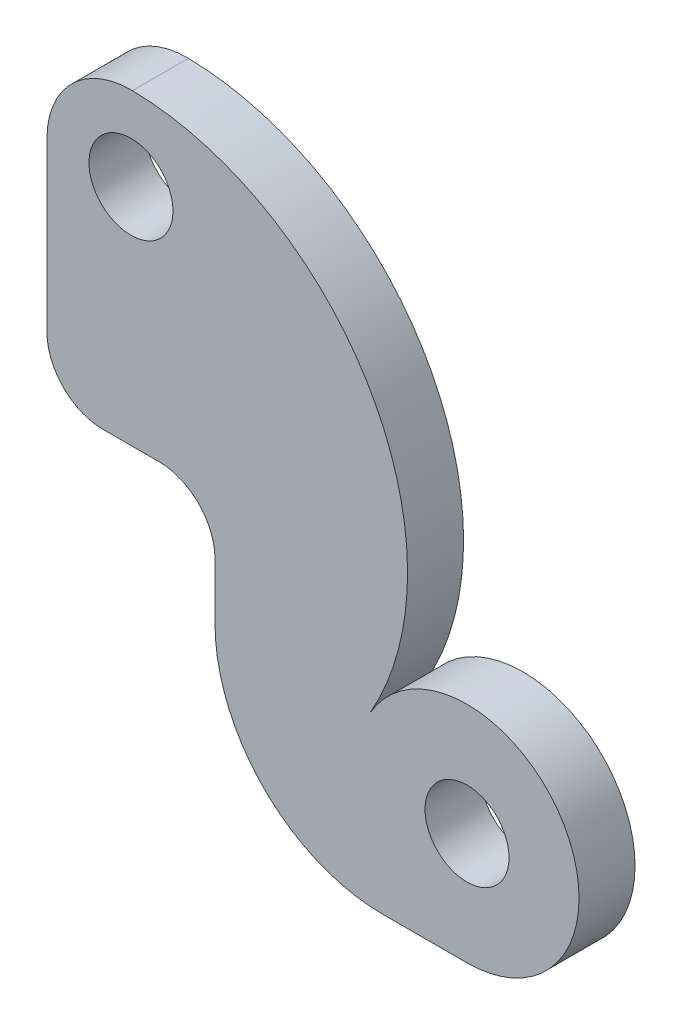
ISO-10303-21;
HEADER;
FILE_DESCRIPTION(('STEP AP214'),'2;1');
FILE_NAME('part.step','',(''),(''),'','','');
FILE_SCHEMA(('AUTOMOTIVE_DESIGN { 1 0 10303 214 1 1 1 1 }'));
ENDSEC;
DATA;
#1=APPLICATION_CONTEXT('core data for automotive mechanical design processes');
#2=APPLICATION_PROTOCOL_DEFINITION('international standard','automotive_design',2000,#1);
#3=PRODUCT_CONTEXT('',#1,'mechanical');
#4=PRODUCT('Part','Part','',(#3));
#5=PRODUCT_RELATED_PRODUCT_CATEGORY('part','',(#4));
#6=PRODUCT_DEFINITION_FORMATION('','',#4);
#7=PRODUCT_DEFINITION_CONTEXT('part definition',#1,'design');
#8=PRODUCT_DEFINITION('design','',#6,#7);
#9=PRODUCT_DEFINITION_SHAPE('','',#8);
#10=(LENGTH_UNIT() NAMED_UNIT(*) SI_UNIT(.MILLI.,.METRE.));
#11=(NAMED_UNIT(*) PLANE_ANGLE_UNIT() SI_UNIT($,.RADIAN.));
#12=(NAMED_UNIT(*) SI_UNIT($,.STERADIAN.) SOLID_ANGLE_UNIT());
#13=UNCERTAINTY_MEASURE_WITH_UNIT(LENGTH_MEASURE(1.E-05),#10,'distance_accuracy_value','');
#14=(GEOMETRIC_REPRESENTATION_CONTEXT(3) GLOBAL_UNCERTAINTY_ASSIGNED_CONTEXT((#13)) GLOBAL_UNIT_ASSIGNED_CONTEXT((#10,
#11,#12)) REPRESENTATION_CONTEXT('',''));
#15=CARTESIAN_POINT('',(0.,0.,0.));
#16=DIRECTION('',(0.,0.,1.));
#17=DIRECTION('',(1.,0.,0.));
#18=AXIS2_PLACEMENT_3D('',#15,#16,#17);
#19=CARTESIAN_POINT('',(0.,0.,5.));
#20=DIRECTION('',(0.,0.,1.));
#21=DIRECTION('',(1.,0.,0.));
#22=AXIS2_PLACEMENT_3D('',#19,#20,#21);
#23=PLANE('',#22);
#24=CARTESIAN_POINT('',(0.,0.,5.));
#25=DIRECTION('',(0.,0.,1.));
#26=DIRECTION('',(1.,0.,0.));
#27=AXIS2_PLACEMENT_3D('',#24,#25,#26);
#28=CIRCLE('',#27,7.5);
#29=CARTESIAN_POINT('',(7.5,0.,5.));
#30=VERTEX_POINT('',#29);
#31=EDGE_CURVE('E146',#30,#30,#28,.T.);
#32=ORIENTED_EDGE('',*,*,#31,.F.);
#33=EDGE_LOOP('',(#32));
#34=FACE_BOUND('',#33,.T.);
#35=CARTESIAN_POINT('',(0.,0.,5.));
#36=DIRECTION('',(0.,0.,1.));
#37=DIRECTION('',(1.,0.,0.));
#38=AXIS2_PLACEMENT_3D('',#35,#36,#37);
#39=CIRCLE('',#38,15.);
#40=CARTESIAN_POINT('',(0.265123412844575,14.9976568028463,5.));
#41=VERTEX_POINT('',#40);
#42=CARTESIAN_POINT('',(-15.,0.,5.));
#43=VERTEX_POINT('',#42);
#44=EDGE_CURVE('E161',#41,#43,#39,.T.);
#45=ORIENTED_EDGE('',*,*,#44,.T.);
#46=DIRECTION('',(0.,-1.,0.));
#47=VECTOR('',#46,1.);
#48=CARTESIAN_POINT('',(-15.,0.,5.));
#49=LINE('',#48,#47);
#50=CARTESIAN_POINT('',(-15.,-29.9999999999999,5.));
#51=VERTEX_POINT('',#50);
#52=EDGE_CURVE('E99',#43,#51,#49,.T.);
#53=ORIENTED_EDGE('',*,*,#52,.T.);
#54=CARTESIAN_POINT('',(-5.,-30.,5.));
#55=DIRECTION('',(0.,0.,1.));
#56=DIRECTION('',(1.,0.,0.));
#57=AXIS2_PLACEMENT_3D('',#54,#55,#56);
#58=CIRCLE('',#57,10.);
#59=CARTESIAN_POINT('',(-4.99999999999993,-40.,5.));
#60=VERTEX_POINT('',#59);
#61=EDGE_CURVE('E182',#51,#60,#58,.T.);
#62=ORIENTED_EDGE('',*,*,#61,.T.);
#63=DIRECTION('',(1.,0.,0.));
#64=VECTOR('',#63,1.);
#65=CARTESIAN_POINT('',(-4.99999999999993,-40.,5.));
#66=LINE('',#65,#64);
#67=CARTESIAN_POINT('',(4.99999999999994,-40.,5.));
#68=VERTEX_POINT('',#67);
#69=EDGE_CURVE('E201',#60,#68,#66,.T.);
#70=ORIENTED_EDGE('',*,*,#69,.T.);
#71=CARTESIAN_POINT('',(5.00000000000001,-50.,5.));
#72=DIRECTION('',(0.,0.,-1.));
#73=DIRECTION('',(-1.,0.,0.));
#74=AXIS2_PLACEMENT_3D('',#71,#72,#73);
#75=CIRCLE('',#74,10.);
#76=CARTESIAN_POINT('',(15.,-50.0000000000001,5.));
#77=VERTEX_POINT('',#76);
#78=EDGE_CURVE('E198',#68,#77,#75,.T.);
#79=ORIENTED_EDGE('',*,*,#78,.T.);
#80=DIRECTION('',(0.,-1.,0.));
#81=VECTOR('',#80,1.);
#82=CARTESIAN_POINT('',(15.,-50.0000000000001,5.));
#83=LINE('',#82,#81);
#84=CARTESIAN_POINT('',(15.,-59.9999999999998,5.));
#85=VERTEX_POINT('',#84);
#86=EDGE_CURVE('E200',#77,#85,#83,.T.);
#87=ORIENTED_EDGE('',*,*,#86,.T.);
#88=CARTESIAN_POINT('',(45.,-60.,5.));
#89=DIRECTION('',(0.,0.,1.));
#90=DIRECTION('',(1.,0.,0.));
#91=AXIS2_PLACEMENT_3D('',#88,#89,#90);
#92=CIRCLE('',#91,30.);
#93=CARTESIAN_POINT('',(45.0000000000002,-90.,5.));
#94=VERTEX_POINT('',#93);
#95=EDGE_CURVE('E124',#85,#94,#92,.T.);
#96=ORIENTED_EDGE('',*,*,#95,.T.);
#97=DIRECTION('',(1.,0.,0.));
#98=VECTOR('',#97,1.);
#99=CARTESIAN_POINT('',(45.0000000000002,-90.,5.));
#100=LINE('',#99,#98);
#101=CARTESIAN_POINT('',(60.,-90.,5.));
#102=VERTEX_POINT('',#101);
#103=EDGE_CURVE('E118',#94,#102,#100,.T.);
#104=ORIENTED_EDGE('',*,*,#103,.T.);
#105=CARTESIAN_POINT('',(60.,-70.,5.));
#106=DIRECTION('',(0.,0.,1.));
#107=DIRECTION('',(1.,0.,0.));
#108=AXIS2_PLACEMENT_3D('',#105,#106,#107);
#109=CIRCLE('',#108,20.0000000000001);
#110=CARTESIAN_POINT('',(42.6803939152464,-59.9984378685643,5.));
#111=VERTEX_POINT('',#110);
#112=EDGE_CURVE('E122',#102,#111,#109,.T.);
#113=ORIENTED_EDGE('',*,*,#112,.T.);
#114=CARTESIAN_POINT('',(-0.618621296637353,-34.9945325399747,5.));
#115=DIRECTION('',(0.,0.,1.));
#116=DIRECTION('',(-1.,0.,0.));
#117=AXIS2_PLACEMENT_3D('',#114,#115,#116);
#118=CIRCLE('',#117,50.);
#119=EDGE_CURVE('E50',#111,#41,#118,.T.);
#120=ORIENTED_EDGE('',*,*,#119,.T.);
#121=EDGE_LOOP('',(#45,#53,#62,#70,#79,#87,#96,#104,#113,#120));
#122=FACE_BOUND('',#121,.T.);
#123=CARTESIAN_POINT('',(60.,-70.,5.));
#124=DIRECTION('',(0.,0.,1.));
#125=DIRECTION('',(1.,0.,0.));
#126=AXIS2_PLACEMENT_3D('',#123,#124,#125);
#127=CIRCLE('',#126,7.5);
#128=CARTESIAN_POINT('',(67.5,-70.,5.));
#129=VERTEX_POINT('',#128);
#130=EDGE_CURVE('E212',#129,#129,#127,.T.);
#131=ORIENTED_EDGE('',*,*,#130,.F.);
#132=EDGE_LOOP('',(#131));
#133=FACE_BOUND('',#132,.T.);
#134=ADVANCED_FACE('F33',(#34,#122,#133),#23,.T.);
#135=CARTESIAN_POINT('',(0.,0.,-5.));
#136=DIRECTION('',(0.,0.,1.));
#137=DIRECTION('',(1.,0.,0.));
#138=AXIS2_PLACEMENT_3D('',#135,#136,#137);
#139=PLANE('',#138);
#140=CARTESIAN_POINT('',(0.,0.,-5.));
#141=DIRECTION('',(0.,0.,1.));
#142=DIRECTION('',(1.,0.,0.));
#143=AXIS2_PLACEMENT_3D('',#140,#141,#142);
#144=CIRCLE('',#143,15.);
#145=CARTESIAN_POINT('',(0.265123412844575,14.9976568028463,-5.));
#146=VERTEX_POINT('',#145);
#147=CARTESIAN_POINT('',(-15.,0.,-5.));
#148=VERTEX_POINT('',#147);
#149=EDGE_CURVE('E142',#146,#148,#144,.T.);
#150=ORIENTED_EDGE('',*,*,#149,.F.);
#151=CARTESIAN_POINT('',(-0.618621296637353,-34.9945325399747,-5.));
#152=DIRECTION('',(0.,0.,1.));
#153=DIRECTION('',(-1.,0.,0.));
#154=AXIS2_PLACEMENT_3D('',#151,#152,#153);
#155=CIRCLE('',#154,50.);
#156=CARTESIAN_POINT('',(42.6803939152464,-59.9984378685643,-5.));
#157=VERTEX_POINT('',#156);
#158=EDGE_CURVE('E91',#157,#146,#155,.T.);
#159=ORIENTED_EDGE('',*,*,#158,.F.);
#160=CARTESIAN_POINT('',(60.,-70.,-5.));
#161=DIRECTION('',(0.,0.,1.));
#162=DIRECTION('',(1.,0.,0.));
#163=AXIS2_PLACEMENT_3D('',#160,#161,#162);
#164=CIRCLE('',#163,20.0000000000001);
#165=CARTESIAN_POINT('',(60.,-90.,-5.));
#166=VERTEX_POINT('',#165);
#167=EDGE_CURVE('E85',#166,#157,#164,.T.);
#168=ORIENTED_EDGE('',*,*,#167,.F.);
#169=DIRECTION('',(1.,0.,0.));
#170=VECTOR('',#169,1.);
#171=CARTESIAN_POINT('',(45.0000000000002,-90.,-5.));
#172=LINE('',#171,#170);
#173=CARTESIAN_POINT('',(45.0000000000002,-90.,-5.));
#174=VERTEX_POINT('',#173);
#175=EDGE_CURVE('E132',#174,#166,#172,.T.);
#176=ORIENTED_EDGE('',*,*,#175,.F.);
#177=CARTESIAN_POINT('',(45.,-60.,-5.));
#178=DIRECTION('',(0.,0.,1.));
#179=DIRECTION('',(1.,0.,0.));
#180=AXIS2_PLACEMENT_3D('',#177,#178,#179);
#181=CIRCLE('',#180,30.);
#182=CARTESIAN_POINT('',(15.,-59.9999999999998,-5.));
#183=VERTEX_POINT('',#182);
#184=EDGE_CURVE('E156',#183,#174,#181,.T.);
#185=ORIENTED_EDGE('',*,*,#184,.F.);
#186=DIRECTION('',(0.,-1.,0.));
#187=VECTOR('',#186,1.);
#188=CARTESIAN_POINT('',(15.,-50.0000000000001,-5.));
#189=LINE('',#188,#187);
#190=CARTESIAN_POINT('',(15.,-50.0000000000001,-5.));
#191=VERTEX_POINT('',#190);
#192=EDGE_CURVE('E154',#191,#183,#189,.T.);
#193=ORIENTED_EDGE('',*,*,#192,.F.);
#194=CARTESIAN_POINT('',(5.00000000000001,-50.,-5.));
#195=DIRECTION('',(0.,0.,-1.));
#196=DIRECTION('',(-1.,0.,0.));
#197=AXIS2_PLACEMENT_3D('',#194,#195,#196);
#198=CIRCLE('',#197,10.);
#199=CARTESIAN_POINT('',(4.99999999999994,-40.,-5.));
#200=VERTEX_POINT('',#199);
#201=EDGE_CURVE('E152',#200,#191,#198,.T.);
#202=ORIENTED_EDGE('',*,*,#201,.F.);
#203=DIRECTION('',(1.,0.,0.));
#204=VECTOR('',#203,1.);
#205=CARTESIAN_POINT('',(-4.99999999999993,-40.,-5.));
#206=LINE('',#205,#204);
#207=CARTESIAN_POINT('',(-4.99999999999993,-40.,-5.));
#208=VERTEX_POINT('',#207);
#209=EDGE_CURVE('E150',#208,#200,#206,.T.);
#210=ORIENTED_EDGE('',*,*,#209,.F.);
#211=CARTESIAN_POINT('',(-5.,-30.,-5.));
#212=DIRECTION('',(0.,0.,1.));
#213=DIRECTION('',(1.,0.,0.));
#214=AXIS2_PLACEMENT_3D('',#211,#212,#213);
#215=CIRCLE('',#214,10.);
#216=CARTESIAN_POINT('',(-15.,-29.9999999999999,-5.));
#217=VERTEX_POINT('',#216);
#218=EDGE_CURVE('E148',#217,#208,#215,.T.);
#219=ORIENTED_EDGE('',*,*,#218,.F.);
#220=DIRECTION('',(0.,-1.,0.));
#221=VECTOR('',#220,1.);
#222=CARTESIAN_POINT('',(-15.,0.,-5.));
#223=LINE('',#222,#221);
#224=EDGE_CURVE('E145',#148,#217,#223,.T.);
#225=ORIENTED_EDGE('',*,*,#224,.F.);
#226=EDGE_LOOP('',(#150,#159,#168,#176,#185,#193,#202,#210,#219,#225));
#227=FACE_BOUND('',#226,.T.);
#228=CARTESIAN_POINT('',(0.,0.,-5.));
#229=DIRECTION('',(0.,0.,1.));
#230=DIRECTION('',(1.,0.,0.));
#231=AXIS2_PLACEMENT_3D('',#228,#229,#230);
#232=CIRCLE('',#231,7.5);
#233=CARTESIAN_POINT('',(7.5,0.,-5.));
#234=VERTEX_POINT('',#233);
#235=EDGE_CURVE('E209',#234,#234,#232,.T.);
#236=ORIENTED_EDGE('',*,*,#235,.T.);
#237=EDGE_LOOP('',(#236));
#238=FACE_BOUND('',#237,.T.);
#239=CARTESIAN_POINT('',(60.,-70.,-5.));
#240=DIRECTION('',(0.,0.,1.));
#241=DIRECTION('',(1.,0.,0.));
#242=AXIS2_PLACEMENT_3D('',#239,#240,#241);
#243=CIRCLE('',#242,7.5);
#244=CARTESIAN_POINT('',(67.5,-70.,-5.));
#245=VERTEX_POINT('',#244);
#246=EDGE_CURVE('E215',#245,#245,#243,.T.);
#247=ORIENTED_EDGE('',*,*,#246,.T.);
#248=EDGE_LOOP('',(#247));
#249=FACE_BOUND('',#248,.T.);
#250=ADVANCED_FACE('F186',(#227,#238,#249),#139,.F.);
#251=CARTESIAN_POINT('',(0.,0.,5.));
#252=DIRECTION('',(0.,0.,-1.));
#253=DIRECTION('',(-1.,0.,0.));
#254=AXIS2_PLACEMENT_3D('',#251,#252,#253);
#255=CYLINDRICAL_SURFACE('',#254,15.);
#256=ORIENTED_EDGE('',*,*,#149,.T.);
#257=DIRECTION('',(0.,0.,-1.));
#258=VECTOR('',#257,1.);
#259=CARTESIAN_POINT('',(-15.,0.,5.));
#260=LINE('',#259,#258);
#261=EDGE_CURVE('E11',#43,#148,#260,.T.);
#262=ORIENTED_EDGE('',*,*,#261,.F.);
#263=ORIENTED_EDGE('',*,*,#44,.F.);
#264=DIRECTION('',(0.,0.,-1.));
#265=VECTOR('',#264,1.);
#266=CARTESIAN_POINT('',(0.265123412844575,14.9976568028463,5.));
#267=LINE('',#266,#265);
#268=EDGE_CURVE('E138',#41,#146,#267,.T.);
#269=ORIENTED_EDGE('',*,*,#268,.T.);
#270=EDGE_LOOP('',(#256,#262,#263,#269));
#271=FACE_BOUND('',#270,.T.);
#272=ADVANCED_FACE('F35',(#271),#255,.T.);
#273=CARTESIAN_POINT('',(-15.,0.,5.));
#274=DIRECTION('',(1.,0.,0.));
#275=DIRECTION('',(0.,0.,-1.));
#276=AXIS2_PLACEMENT_3D('',#273,#274,#275);
#277=PLANE('',#276);
#278=ORIENTED_EDGE('',*,*,#224,.T.);
#279=DIRECTION('',(0.,0.,-1.));
#280=VECTOR('',#279,1.);
#281=CARTESIAN_POINT('',(-15.,-29.9999999999999,5.));
#282=LINE('',#281,#280);
#283=EDGE_CURVE('E42',#51,#217,#282,.T.);
#284=ORIENTED_EDGE('',*,*,#283,.F.);
#285=ORIENTED_EDGE('',*,*,#52,.F.);
#286=ORIENTED_EDGE('',*,*,#261,.T.);
#287=EDGE_LOOP('',(#278,#284,#285,#286));
#288=FACE_BOUND('',#287,.T.);
#289=ADVANCED_FACE('F255',(#288),#277,.F.);
#290=CARTESIAN_POINT('',(-5.,-30.,5.));
#291=DIRECTION('',(0.,0.,-1.));
#292=DIRECTION('',(-1.,0.,0.));
#293=AXIS2_PLACEMENT_3D('',#290,#291,#292);
#294=CYLINDRICAL_SURFACE('',#293,10.);
#295=ORIENTED_EDGE('',*,*,#218,.T.);
#296=DIRECTION('',(0.,0.,-1.));
#297=VECTOR('',#296,1.);
#298=CARTESIAN_POINT('',(-4.99999999999993,-40.,5.));
#299=LINE('',#298,#297);
#300=EDGE_CURVE('E174',#60,#208,#299,.T.);
#301=ORIENTED_EDGE('',*,*,#300,.F.);
#302=ORIENTED_EDGE('',*,*,#61,.F.);
#303=ORIENTED_EDGE('',*,*,#283,.T.);
#304=EDGE_LOOP('',(#295,#301,#302,#303));
#305=FACE_BOUND('',#304,.T.);
#306=ADVANCED_FACE('F180',(#305),#294,.T.);
#307=CARTESIAN_POINT('',(-4.99999999999993,-40.,5.));
#308=DIRECTION('',(0.,1.,0.));
#309=DIRECTION('',(0.,0.,1.));
#310=AXIS2_PLACEMENT_3D('',#307,#308,#309);
#311=PLANE('',#310);
#312=ORIENTED_EDGE('',*,*,#209,.T.);
#313=DIRECTION('',(0.,0.,-1.));
#314=VECTOR('',#313,1.);
#315=CARTESIAN_POINT('',(4.99999999999994,-40.,5.));
#316=LINE('',#315,#314);
#317=EDGE_CURVE('E171',#68,#200,#316,.T.);
#318=ORIENTED_EDGE('',*,*,#317,.F.);
#319=ORIENTED_EDGE('',*,*,#69,.F.);
#320=ORIENTED_EDGE('',*,*,#300,.T.);
#321=EDGE_LOOP('',(#312,#318,#319,#320));
#322=FACE_BOUND('',#321,.T.);
#323=ADVANCED_FACE('F192',(#322),#311,.F.);
#324=CARTESIAN_POINT('',(5.00000000000001,-50.,5.));
#325=DIRECTION('',(0.,0.,-1.));
#326=DIRECTION('',(-1.,0.,0.));
#327=AXIS2_PLACEMENT_3D('',#324,#325,#326);
#328=CYLINDRICAL_SURFACE('',#327,10.);
#329=ORIENTED_EDGE('',*,*,#201,.T.);
#330=DIRECTION('',(0.,0.,-1.));
#331=VECTOR('',#330,1.);
#332=CARTESIAN_POINT('',(15.,-50.0000000000001,5.));
#333=LINE('',#332,#331);
#334=EDGE_CURVE('E168',#77,#191,#333,.T.);
#335=ORIENTED_EDGE('',*,*,#334,.F.);
#336=ORIENTED_EDGE('',*,*,#78,.F.);
#337=ORIENTED_EDGE('',*,*,#317,.T.);
#338=EDGE_LOOP('',(#329,#335,#336,#337));
#339=FACE_BOUND('',#338,.T.);
#340=ADVANCED_FACE('F196',(#339),#328,.F.);
#341=CARTESIAN_POINT('',(15.,-50.0000000000001,5.));
#342=DIRECTION('',(1.,0.,0.));
#343=DIRECTION('',(0.,1.,0.));
#344=AXIS2_PLACEMENT_3D('',#341,#342,#343);
#345=PLANE('',#344);
#346=ORIENTED_EDGE('',*,*,#192,.T.);
#347=DIRECTION('',(0.,0.,-1.));
#348=VECTOR('',#347,1.);
#349=CARTESIAN_POINT('',(15.,-59.9999999999998,5.));
#350=LINE('',#349,#348);
#351=EDGE_CURVE('E165',#85,#183,#350,.T.);
#352=ORIENTED_EDGE('',*,*,#351,.F.);
#353=ORIENTED_EDGE('',*,*,#86,.F.);
#354=ORIENTED_EDGE('',*,*,#334,.T.);
#355=EDGE_LOOP('',(#346,#352,#353,#354));
#356=FACE_BOUND('',#355,.T.);
#357=ADVANCED_FACE('F245',(#356),#345,.F.);
#358=CARTESIAN_POINT('',(45.,-60.,5.));
#359=DIRECTION('',(0.,0.,-1.));
#360=DIRECTION('',(-1.,0.,0.));
#361=AXIS2_PLACEMENT_3D('',#358,#359,#360);
#362=CYLINDRICAL_SURFACE('',#361,30.);
#363=ORIENTED_EDGE('',*,*,#184,.T.);
#364=DIRECTION('',(0.,0.,-1.));
#365=VECTOR('',#364,1.);
#366=CARTESIAN_POINT('',(45.0000000000002,-90.,5.));
#367=LINE('',#366,#365);
#368=EDGE_CURVE('E133',#94,#174,#367,.T.);
#369=ORIENTED_EDGE('',*,*,#368,.F.);
#370=ORIENTED_EDGE('',*,*,#95,.F.);
#371=ORIENTED_EDGE('',*,*,#351,.T.);
#372=EDGE_LOOP('',(#363,#369,#370,#371));
#373=FACE_BOUND('',#372,.T.);
#374=ADVANCED_FACE('F242',(#373),#362,.T.);
#375=CARTESIAN_POINT('',(45.0000000000002,-90.,5.));
#376=DIRECTION('',(0.,1.,0.));
#377=DIRECTION('',(0.,0.,1.));
#378=AXIS2_PLACEMENT_3D('',#375,#376,#377);
#379=PLANE('',#378);
#380=ORIENTED_EDGE('',*,*,#175,.T.);
#381=DIRECTION('',(0.,0.,-1.));
#382=VECTOR('',#381,1.);
#383=CARTESIAN_POINT('',(60.,-90.,5.));
#384=LINE('',#383,#382);
#385=EDGE_CURVE('E129',#102,#166,#384,.T.);
#386=ORIENTED_EDGE('',*,*,#385,.F.);
#387=ORIENTED_EDGE('',*,*,#103,.F.);
#388=ORIENTED_EDGE('',*,*,#368,.T.);
#389=EDGE_LOOP('',(#380,#386,#387,#388));
#390=FACE_BOUND('',#389,.T.);
#391=ADVANCED_FACE('F130',(#390),#379,.F.);
#392=CARTESIAN_POINT('',(60.,-70.,5.));
#393=DIRECTION('',(0.,0.,-1.));
#394=DIRECTION('',(-1.,0.,0.));
#395=AXIS2_PLACEMENT_3D('',#392,#393,#394);
#396=CYLINDRICAL_SURFACE('',#395,20.0000000000001);
#397=ORIENTED_EDGE('',*,*,#167,.T.);
#398=DIRECTION('',(0.,0.,-1.));
#399=VECTOR('',#398,1.);
#400=CARTESIAN_POINT('',(42.6803939152464,-59.9984378685643,5.));
#401=LINE('',#400,#399);
#402=EDGE_CURVE('E134',#111,#157,#401,.T.);
#403=ORIENTED_EDGE('',*,*,#402,.F.);
#404=ORIENTED_EDGE('',*,*,#112,.F.);
#405=ORIENTED_EDGE('',*,*,#385,.T.);
#406=EDGE_LOOP('',(#397,#403,#404,#405));
#407=FACE_BOUND('',#406,.T.);
#408=ADVANCED_FACE('F136',(#407),#396,.T.);
#409=CARTESIAN_POINT('',(-0.618621296637353,-34.9945325399747,5.));
#410=DIRECTION('',(0.,0.,-1.));
#411=DIRECTION('',(-1.,0.,0.));
#412=AXIS2_PLACEMENT_3D('',#409,#410,#411);
#413=CYLINDRICAL_SURFACE('',#412,50.);
#414=ORIENTED_EDGE('',*,*,#158,.T.);
#415=ORIENTED_EDGE('',*,*,#268,.F.);
#416=ORIENTED_EDGE('',*,*,#119,.F.);
#417=ORIENTED_EDGE('',*,*,#402,.T.);
#418=EDGE_LOOP('',(#414,#415,#416,#417));
#419=FACE_BOUND('',#418,.T.);
#420=ADVANCED_FACE('F235',(#419),#413,.T.);
#421=CARTESIAN_POINT('',(0.,0.,5.));
#422=DIRECTION('',(0.,0.,-1.));
#423=DIRECTION('',(-1.,0.,0.));
#424=AXIS2_PLACEMENT_3D('',#421,#422,#423);
#425=CYLINDRICAL_SURFACE('',#424,7.5);
#426=ORIENTED_EDGE('',*,*,#31,.T.);
#427=EDGE_LOOP('',(#426));
#428=FACE_BOUND('',#427,.T.);
#429=ORIENTED_EDGE('',*,*,#235,.F.);
#430=EDGE_LOOP('',(#429));
#431=FACE_BOUND('',#430,.T.);
#432=ADVANCED_FACE('F232',(#428,#431),#425,.F.);
#433=CARTESIAN_POINT('',(60.,-70.,5.));
#434=DIRECTION('',(0.,0.,-1.));
#435=DIRECTION('',(-1.,0.,0.));
#436=AXIS2_PLACEMENT_3D('',#433,#434,#435);
#437=CYLINDRICAL_SURFACE('',#436,7.5);
#438=ORIENTED_EDGE('',*,*,#130,.T.);
#439=EDGE_LOOP('',(#438));
#440=FACE_BOUND('',#439,.T.);
#441=ORIENTED_EDGE('',*,*,#246,.F.);
#442=EDGE_LOOP('',(#441));
#443=FACE_BOUND('',#442,.T.);
#444=ADVANCED_FACE('F221',(#440,#443),#437,.F.);
#445=CLOSED_SHELL('',(#134,#250,#272,#289,#306,#323,#340,#357,#374,#391,#408,#420,#432,#444));
#446=MANIFOLD_SOLID_BREP('B2',#445);
#447=ADVANCED_BREP_SHAPE_REPRESENTATION('',(#18,#446),#14);
#448=SHAPE_DEFINITION_REPRESENTATION(#9,#447);
ENDSEC;
END-ISO-10303-21;
